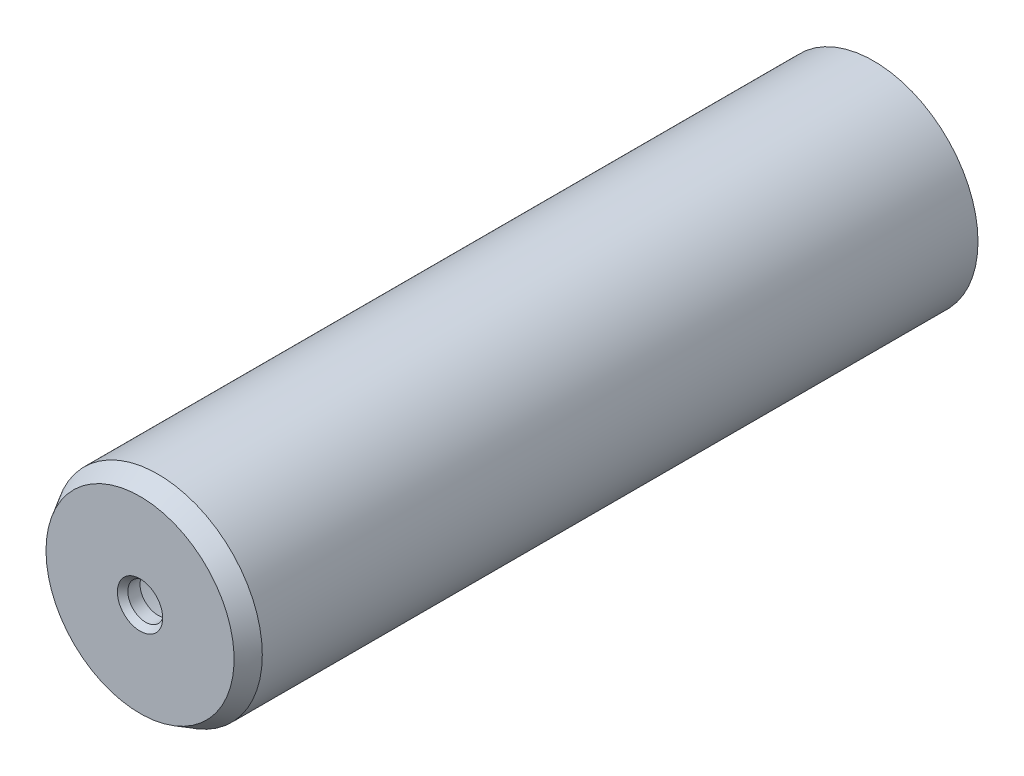
ISO-10303-21;
HEADER;
FILE_DESCRIPTION(('STEP AP214'),'2;1');
FILE_NAME('part.step','',(''),(''),'','','');
FILE_SCHEMA(('AUTOMOTIVE_DESIGN { 1 0 10303 214 1 1 1 1 }'));
ENDSEC;
DATA;
#1=APPLICATION_CONTEXT('core data for automotive mechanical design processes');
#2=APPLICATION_PROTOCOL_DEFINITION('international standard','automotive_design',2000,#1);
#3=PRODUCT_CONTEXT('',#1,'mechanical');
#4=PRODUCT('Part','Part','',(#3));
#5=PRODUCT_RELATED_PRODUCT_CATEGORY('part','',(#4));
#6=PRODUCT_DEFINITION_FORMATION('','',#4);
#7=PRODUCT_DEFINITION_CONTEXT('part definition',#1,'design');
#8=PRODUCT_DEFINITION('design','',#6,#7);
#9=PRODUCT_DEFINITION_SHAPE('','',#8);
#10=(LENGTH_UNIT() NAMED_UNIT(*) SI_UNIT(.MILLI.,.METRE.));
#11=(NAMED_UNIT(*) PLANE_ANGLE_UNIT() SI_UNIT($,.RADIAN.));
#12=(NAMED_UNIT(*) SI_UNIT($,.STERADIAN.) SOLID_ANGLE_UNIT());
#13=UNCERTAINTY_MEASURE_WITH_UNIT(LENGTH_MEASURE(1.E-05),#10,'distance_accuracy_value','');
#14=(GEOMETRIC_REPRESENTATION_CONTEXT(3) GLOBAL_UNCERTAINTY_ASSIGNED_CONTEXT((#13)) GLOBAL_UNIT_ASSIGNED_CONTEXT((#10,
#11,#12)) REPRESENTATION_CONTEXT('',''));
#15=CARTESIAN_POINT('',(0.,0.,0.));
#16=DIRECTION('',(0.,0.,1.));
#17=DIRECTION('',(1.,0.,0.));
#18=AXIS2_PLACEMENT_3D('',#15,#16,#17);
#19=CARTESIAN_POINT('',(0.,0.,0.));
#20=DIRECTION('',(0.,0.,1.));
#21=DIRECTION('',(1.,0.,0.));
#22=AXIS2_PLACEMENT_3D('',#19,#20,#21);
#23=PLANE('',#22);
#24=CARTESIAN_POINT('',(0.,0.,0.));
#25=DIRECTION('',(0.,0.,1.));
#26=DIRECTION('',(1.,0.,0.));
#27=AXIS2_PLACEMENT_3D('',#24,#25,#26);
#28=CIRCLE('',#27,17.5);
#29=CARTESIAN_POINT('',(17.5,0.,0.));
#30=VERTEX_POINT('',#29);
#31=EDGE_CURVE('E106',#30,#30,#28,.T.);
#32=ORIENTED_EDGE('',*,*,#31,.F.);
#33=EDGE_LOOP('',(#32));
#34=FACE_BOUND('',#33,.T.);
#35=CARTESIAN_POINT('',(0.,0.,0.));
#36=DIRECTION('',(0.,0.,1.));
#37=DIRECTION('',(1.,0.,0.));
#38=AXIS2_PLACEMENT_3D('',#35,#36,#37);
#39=CIRCLE('',#38,15.1);
#40=CARTESIAN_POINT('',(15.1,0.,0.));
#41=VERTEX_POINT('',#40);
#42=EDGE_CURVE('E109',#41,#41,#39,.T.);
#43=ORIENTED_EDGE('',*,*,#42,.T.);
#44=EDGE_LOOP('',(#43));
#45=FACE_BOUND('',#44,.T.);
#46=ADVANCED_FACE('F35',(#34,#45),#23,.F.);
#47=CARTESIAN_POINT('',(0.,0.,120.));
#48=DIRECTION('',(0.,0.,-1.));
#49=DIRECTION('',(-1.,0.,0.));
#50=AXIS2_PLACEMENT_3D('',#47,#48,#49);
#51=CYLINDRICAL_SURFACE('',#50,17.5);
#52=CARTESIAN_POINT('',(0.,0.,120.));
#53=DIRECTION('',(0.,0.,1.));
#54=DIRECTION('',(1.,0.,0.));
#55=AXIS2_PLACEMENT_3D('',#52,#53,#54);
#56=CIRCLE('',#55,17.5);
#57=CARTESIAN_POINT('',(-17.5,0.,120.));
#58=VERTEX_POINT('',#57);
#59=EDGE_CURVE('E100',#58,#58,#56,.F.);
#60=ORIENTED_EDGE('',*,*,#59,.T.);
#61=EDGE_LOOP('',(#60));
#62=FACE_BOUND('',#61,.T.);
#63=ORIENTED_EDGE('',*,*,#31,.T.);
#64=EDGE_LOOP('',(#63));
#65=FACE_BOUND('',#64,.T.);
#66=ADVANCED_FACE('F147',(#62,#65),#51,.T.);
#67=CARTESIAN_POINT('',(0.,0.,120.));
#68=DIRECTION('',(0.,0.,-1.));
#69=DIRECTION('',(-1.,0.,0.));
#70=AXIS2_PLACEMENT_3D('',#67,#68,#69);
#71=CYLINDRICAL_SURFACE('',#70,15.1);
#72=CARTESIAN_POINT('',(0.,0.,20.));
#73=DIRECTION('',(0.,0.,-1.));
#74=DIRECTION('',(1.,0.,0.));
#75=AXIS2_PLACEMENT_3D('',#72,#73,#74);
#76=CIRCLE('',#75,15.1);
#77=CARTESIAN_POINT('',(-14.4402018150418,-4.41481274131339,20.));
#78=VERTEX_POINT('',#77);
#79=CARTESIAN_POINT('',(0.,15.1,20.));
#80=VERTEX_POINT('',#79);
#81=EDGE_CURVE('E84',#78,#80,#76,.T.);
#82=ORIENTED_EDGE('',*,*,#81,.T.);
#83=DIRECTION('',(0.,0.,-1.));
#84=VECTOR('',#83,1.);
#85=CARTESIAN_POINT('',(0.,15.1,20.));
#86=LINE('',#85,#84);
#87=CARTESIAN_POINT('',(0.,15.1,6.));
#88=VERTEX_POINT('',#87);
#89=EDGE_CURVE('E75',#80,#88,#86,.T.);
#90=ORIENTED_EDGE('',*,*,#89,.T.);
#91=CARTESIAN_POINT('',(0.,0.,6.));
#92=DIRECTION('',(0.,0.,-1.));
#93=DIRECTION('',(1.,0.,0.));
#94=AXIS2_PLACEMENT_3D('',#91,#92,#93);
#95=CIRCLE('',#94,15.1);
#96=CARTESIAN_POINT('',(-14.4402018150418,-4.41481274131339,6.00000000000001));
#97=VERTEX_POINT('',#96);
#98=EDGE_CURVE('E127',#97,#88,#95,.T.);
#99=ORIENTED_EDGE('',*,*,#98,.F.);
#100=DIRECTION('',(0.,0.,-1.));
#101=VECTOR('',#100,1.);
#102=CARTESIAN_POINT('',(-14.4402018150418,-4.41481274131339,20.));
#103=LINE('',#102,#101);
#104=EDGE_CURVE('E90',#78,#97,#103,.T.);
#105=ORIENTED_EDGE('',*,*,#104,.F.);
#106=EDGE_LOOP('',(#82,#90,#99,#105));
#107=FACE_BOUND('',#106,.T.);
#108=CARTESIAN_POINT('',(0.,0.,120.));
#109=DIRECTION('',(0.,0.,1.));
#110=DIRECTION('',(1.,0.,0.));
#111=AXIS2_PLACEMENT_3D('',#108,#109,#110);
#112=CIRCLE('',#111,15.1);
#113=CARTESIAN_POINT('',(15.1,0.,120.));
#114=VERTEX_POINT('',#113);
#115=EDGE_CURVE('E112',#114,#114,#112,.T.);
#116=ORIENTED_EDGE('',*,*,#115,.T.);
#117=EDGE_LOOP('',(#116));
#118=FACE_BOUND('',#117,.T.);
#119=ORIENTED_EDGE('',*,*,#42,.F.);
#120=EDGE_LOOP('',(#119));
#121=FACE_BOUND('',#120,.T.);
#122=ADVANCED_FACE('F87',(#107,#118,#121),#71,.F.);
#123=CARTESIAN_POINT('',(0.,0.,120.));
#124=DIRECTION('',(0.,0.,1.));
#125=DIRECTION('',(1.,0.,0.));
#126=AXIS2_PLACEMENT_3D('',#123,#124,#125);
#127=PLANE('',#126);
#128=CARTESIAN_POINT('',(0.,0.,120.));
#129=DIRECTION('',(0.,0.,1.));
#130=DIRECTION('',(1.,0.,0.));
#131=AXIS2_PLACEMENT_3D('',#128,#129,#130);
#132=CIRCLE('',#131,3.);
#133=CARTESIAN_POINT('',(3.,0.,120.));
#134=VERTEX_POINT('',#133);
#135=EDGE_CURVE('E115',#134,#134,#132,.T.);
#136=ORIENTED_EDGE('',*,*,#135,.T.);
#137=EDGE_LOOP('',(#136));
#138=FACE_BOUND('',#137,.T.);
#139=ORIENTED_EDGE('',*,*,#115,.F.);
#140=EDGE_LOOP('',(#139));
#141=FACE_BOUND('',#140,.T.);
#142=ADVANCED_FACE('F196',(#138,#141),#127,.F.);
#143=CARTESIAN_POINT('',(0.,0.,123.));
#144=DIRECTION('',(0.,0.,1.));
#145=DIRECTION('',(1.,0.,0.));
#146=AXIS2_PLACEMENT_3D('',#143,#144,#145);
#147=PLANE('',#146);
#148=CARTESIAN_POINT('',(0.,0.,123.));
#149=DIRECTION('',(0.,0.,1.));
#150=DIRECTION('',(1.,0.,0.));
#151=AXIS2_PLACEMENT_3D('',#148,#149,#150);
#152=CIRCLE('',#151,3.8);
#153=CARTESIAN_POINT('',(3.8,0.,123.));
#154=VERTEX_POINT('',#153);
#155=EDGE_CURVE('E11',#154,#154,#152,.F.);
#156=ORIENTED_EDGE('',*,*,#155,.T.);
#157=EDGE_LOOP('',(#156));
#158=FACE_BOUND('',#157,.T.);
#159=CARTESIAN_POINT('',(0.,0.,123.));
#160=DIRECTION('',(0.,0.,1.));
#161=DIRECTION('',(1.,0.,0.));
#162=AXIS2_PLACEMENT_3D('',#159,#160,#161);
#163=CIRCLE('',#162,15.7679491924311);
#164=CARTESIAN_POINT('',(-15.7679491924311,0.,123.));
#165=VERTEX_POINT('',#164);
#166=EDGE_CURVE('E103',#165,#165,#163,.T.);
#167=ORIENTED_EDGE('',*,*,#166,.T.);
#168=EDGE_LOOP('',(#167));
#169=FACE_BOUND('',#168,.T.);
#170=ADVANCED_FACE('F191',(#158,#169),#147,.T.);
#171=CARTESIAN_POINT('',(0.,0.,123.));
#172=DIRECTION('',(0.,0.,-1.));
#173=DIRECTION('',(-1.,0.,0.));
#174=AXIS2_PLACEMENT_3D('',#171,#172,#173);
#175=CYLINDRICAL_SURFACE('',#174,3.);
#176=CARTESIAN_POINT('',(0.,0.,122.046597125925));
#177=DIRECTION('',(0.,0.,1.));
#178=DIRECTION('',(1.,0.,0.));
#179=AXIS2_PLACEMENT_3D('',#176,#177,#178);
#180=CIRCLE('',#179,3.);
#181=CARTESIAN_POINT('',(3.,0.,122.046597125925));
#182=VERTEX_POINT('',#181);
#183=EDGE_CURVE('E43',#182,#182,#180,.T.);
#184=ORIENTED_EDGE('',*,*,#183,.T.);
#185=EDGE_LOOP('',(#184));
#186=FACE_BOUND('',#185,.T.);
#187=ORIENTED_EDGE('',*,*,#135,.F.);
#188=EDGE_LOOP('',(#187));
#189=FACE_BOUND('',#188,.T.);
#190=ADVANCED_FACE('F161',(#186,#189),#175,.F.);
#191=CARTESIAN_POINT('',(0.,0.,123.));
#192=DIRECTION('',(0.,0.,-1.));
#193=DIRECTION('',(-1.,0.,0.));
#194=AXIS2_PLACEMENT_3D('',#191,#192,#193);
#195=CONICAL_SURFACE('',#194,15.7679491924311,0.523598775598295);
#196=CARTESIAN_POINT('',(-17.5,0.,120.));
#197=CARTESIAN_POINT('',(-17.4819578040878,0.,120.03125));
#198=CARTESIAN_POINT('',(-17.4639156081757,0.,120.0625));
#199=CARTESIAN_POINT('',(-17.4278312163513,0.,120.125));
#200=CARTESIAN_POINT('',(-17.4097890204391,0.,120.15625));
#201=CARTESIAN_POINT('',(-17.3737046286148,0.,120.21875));
#202=CARTESIAN_POINT('',(-17.3556624327026,0.,120.25));
#203=CARTESIAN_POINT('',(-17.3195780408783,0.,120.3125));
#204=CARTESIAN_POINT('',(-17.3015358449661,0.,120.34375));
#205=CARTESIAN_POINT('',(-17.2654514531417,0.,120.40625));
#206=CARTESIAN_POINT('',(-17.2474092572295,0.,120.4375));
#207=CARTESIAN_POINT('',(-17.2113248654052,0.,120.5));
#208=CARTESIAN_POINT('',(-17.193282669493,0.,120.53125));
#209=CARTESIAN_POINT('',(-17.1571982776687,0.,120.59375));
#210=CARTESIAN_POINT('',(-17.1391560817565,0.,120.625));
#211=CARTESIAN_POINT('',(-17.1030716899321,0.,120.6875));
#212=CARTESIAN_POINT('',(-17.08502949402,0.,120.71875));
#213=CARTESIAN_POINT('',(-17.0489451021956,0.,120.78125));
#214=CARTESIAN_POINT('',(-17.0309029062834,0.,120.8125));
#215=CARTESIAN_POINT('',(-16.9948185144591,0.,120.875));
#216=CARTESIAN_POINT('',(-16.9767763185469,0.,120.90625));
#217=CARTESIAN_POINT('',(-16.9406919267226,0.,120.96875));
#218=CARTESIAN_POINT('',(-16.9226497308104,0.,121.));
#219=CARTESIAN_POINT('',(-16.886565338986,0.,121.0625));
#220=CARTESIAN_POINT('',(-16.8685231430738,0.,121.09375));
#221=CARTESIAN_POINT('',(-16.8324387512495,0.,121.15625));
#222=CARTESIAN_POINT('',(-16.8143965553373,0.,121.1875));
#223=CARTESIAN_POINT('',(-16.778312163513,0.,121.25));
#224=CARTESIAN_POINT('',(-16.7602699676008,0.,121.28125));
#225=CARTESIAN_POINT('',(-16.7241855757764,0.,121.34375));
#226=CARTESIAN_POINT('',(-16.7061433798643,0.,121.375));
#227=CARTESIAN_POINT('',(-16.6700589880399,0.,121.4375));
#228=CARTESIAN_POINT('',(-16.6520167921277,0.,121.46875));
#229=CARTESIAN_POINT('',(-16.6159324003034,0.,121.53125));
#230=CARTESIAN_POINT('',(-16.5978902043912,0.,121.5625));
#231=CARTESIAN_POINT('',(-16.5618058125669,0.,121.625));
#232=CARTESIAN_POINT('',(-16.5437636166547,0.,121.65625));
#233=CARTESIAN_POINT('',(-16.5076792248303,0.,121.71875));
#234=CARTESIAN_POINT('',(-16.4896370289181,0.,121.75));
#235=CARTESIAN_POINT('',(-16.4535526370938,0.,121.8125));
#236=CARTESIAN_POINT('',(-16.4355104411816,0.,121.84375));
#237=CARTESIAN_POINT('',(-16.3994260493573,0.,121.90625));
#238=CARTESIAN_POINT('',(-16.3813838534451,0.,121.9375));
#239=CARTESIAN_POINT('',(-16.3452994616207,0.,122.));
#240=CARTESIAN_POINT('',(-16.3272572657086,0.,122.03125));
#241=CARTESIAN_POINT('',(-16.2911728738842,0.,122.09375));
#242=CARTESIAN_POINT('',(-16.273130677972,0.,122.125));
#243=CARTESIAN_POINT('',(-16.2370462861477,0.,122.1875));
#244=CARTESIAN_POINT('',(-16.2190040902355,0.,122.21875));
#245=CARTESIAN_POINT('',(-16.1829196984112,0.,122.28125));
#246=CARTESIAN_POINT('',(-16.164877502499,0.,122.3125));
#247=CARTESIAN_POINT('',(-16.1287931106746,0.,122.375));
#248=CARTESIAN_POINT('',(-16.1107509147624,0.,122.40625));
#249=CARTESIAN_POINT('',(-16.0746665229381,0.,122.46875));
#250=CARTESIAN_POINT('',(-16.0566243270259,0.,122.5));
#251=CARTESIAN_POINT('',(-16.0205399352016,0.,122.5625));
#252=CARTESIAN_POINT('',(-16.0024977392894,0.,122.59375));
#253=CARTESIAN_POINT('',(-15.966413347465,0.,122.65625));
#254=CARTESIAN_POINT('',(-15.9483711515529,0.,122.6875));
#255=CARTESIAN_POINT('',(-15.9122867597285,0.,122.75));
#256=CARTESIAN_POINT('',(-15.8942445638163,0.,122.78125));
#257=CARTESIAN_POINT('',(-15.858160171992,0.,122.84375));
#258=CARTESIAN_POINT('',(-15.8401179760798,0.,122.875));
#259=CARTESIAN_POINT('',(-15.8040335842555,0.,122.9375));
#260=CARTESIAN_POINT('',(-15.7859913883433,0.,122.96875));
#261=CARTESIAN_POINT('',(-15.7679491924311,0.,123.));
#262=B_SPLINE_CURVE_WITH_KNOTS('',3,(#196,#197,#198,#199,#200,#201,#202,#203,#204,#205,#206,
#207,#208,#209,#210,#211,#212,#213,#214,#215,#216,#217,#218,#219,#220,#221,#222,#223,#224,#225,
#226,#227,#228,#229,#230,#231,#232,#233,#234,#235,#236,#237,#238,#239,#240,#241,#242,#243,#244,
#245,#246,#247,#248,#249,#250,#251,#252,#253,#254,#255,#256,#257,#258,#259,#260,#261),
.UNSPECIFIED.,.F.,.F.,(4,2,2,2,2,2,2,2,2,2,2,2,2,2,2,2,2,2,2,2,2,2,2,2,2,2,2,2,2,2,2,2,4),(0.,
0.108253175473046,0.216506350946104,0.324759526419162,0.43301270189222,0.54126587736528,
0.649519052838338,0.757772228311396,0.866025403784454,0.974278579257512,1.08253175473057,
1.19078493020363,1.29903810567668,1.40729128114973,1.51554445662279,1.62379763209585,
1.73205080756891,1.84030398304197,1.94855715851503,2.05681033398808,2.16506350946114,
2.2733166849342,2.38156986040725,2.4898230358803,2.59807621135336,2.70632938682642,
2.81458256229948,2.92283573777254,3.0310889132456,3.13934208871865,3.24759526419171,
3.35584843966477,3.46410161513783),.UNSPECIFIED.);
#263=EDGE_CURVE('BSEAM144',#58,#165,#262,.T.);
#264=ORIENTED_EDGE('',*,*,#59,.F.);
#265=ORIENTED_EDGE('',*,*,#166,.F.);
#266=ORIENTED_EDGE('',*,*,#263,.T.);
#267=ORIENTED_EDGE('',*,*,#263,.F.);
#268=EDGE_LOOP('',(#264,#266,#265,#267));
#269=FACE_BOUND('',#268,.T.);
#270=ADVANCED_FACE('F144',(#269),#195,.T.);
#271=CARTESIAN_POINT('',(-10.6149827911897,-3.24532592242242,20.));
#272=DIRECTION('',(0.292371704722741,-0.956304755963034,0.));
#273=DIRECTION('',(0.956304755963034,0.292371704722741,0.));
#274=AXIS2_PLACEMENT_3D('',#271,#272,#273);
#275=PLANE('',#274);
#276=DIRECTION('',(0.,0.,-1.));
#277=VECTOR('',#276,1.);
#278=CARTESIAN_POINT('',(-10.6149827911897,-3.24532592242242,20.));
#279=LINE('',#278,#277);
#280=CARTESIAN_POINT('',(-10.6149827911897,-3.24532592242242,9.01009032218146));
#281=VERTEX_POINT('',#280);
#282=CARTESIAN_POINT('',(-10.6149827911897,-3.24532592242242,6.));
#283=VERTEX_POINT('',#282);
#284=EDGE_CURVE('E119',#281,#283,#279,.T.);
#285=ORIENTED_EDGE('',*,*,#284,.F.);
#286=DIRECTION('',(0.327075489697496,0.0999970123536421,-0.939692620785909));
#287=VECTOR('',#286,1.);
#288=CARTESIAN_POINT('',(0.,0.,-21.4869090337648));
#289=LINE('',#288,#287);
#290=EDGE_CURVE('E50',#281,#78,#289,.F.);
#291=ORIENTED_EDGE('',*,*,#290,.T.);
#292=ORIENTED_EDGE('',*,*,#104,.T.);
#293=DIRECTION('',(-0.956304755963034,-0.292371704722741,0.));
#294=VECTOR('',#293,1.);
#295=CARTESIAN_POINT('',(-10.6149827911897,-3.24532592242242,6.));
#296=LINE('',#295,#294);
#297=EDGE_CURVE('E91',#283,#97,#296,.T.);
#298=ORIENTED_EDGE('',*,*,#297,.F.);
#299=EDGE_LOOP('',(#285,#291,#292,#298));
#300=FACE_BOUND('',#299,.T.);
#301=ADVANCED_FACE('F134',(#300),#275,.T.);
#302=CARTESIAN_POINT('',(0.,0.,20.));
#303=DIRECTION('',(0.,0.,-1.));
#304=DIRECTION('',(-1.,0.,0.));
#305=AXIS2_PLACEMENT_3D('',#302,#303,#304);
#306=CYLINDRICAL_SURFACE('',#305,11.1);
#307=DIRECTION('',(0.,0.,-1.));
#308=VECTOR('',#307,1.);
#309=CARTESIAN_POINT('',(0.,11.1,20.));
#310=LINE('',#309,#308);
#311=CARTESIAN_POINT('',(0.,11.1,9.01009032218146));
#312=VERTEX_POINT('',#311);
#313=CARTESIAN_POINT('',(0.,11.1,6.));
#314=VERTEX_POINT('',#313);
#315=EDGE_CURVE('E83',#312,#314,#310,.T.);
#316=ORIENTED_EDGE('',*,*,#315,.F.);
#317=CARTESIAN_POINT('',(0.,0.,9.01009032218146));
#318=DIRECTION('',(0.,0.,1.));
#319=DIRECTION('',(1.,0.,0.));
#320=AXIS2_PLACEMENT_3D('',#317,#318,#319);
#321=CIRCLE('',#320,11.1);
#322=EDGE_CURVE('E94',#312,#281,#321,.T.);
#323=ORIENTED_EDGE('',*,*,#322,.T.);
#324=ORIENTED_EDGE('',*,*,#284,.T.);
#325=CARTESIAN_POINT('',(0.,0.,6.));
#326=DIRECTION('',(0.,0.,1.));
#327=DIRECTION('',(1.,0.,0.));
#328=AXIS2_PLACEMENT_3D('',#325,#326,#327);
#329=CIRCLE('',#328,11.1);
#330=EDGE_CURVE('E123',#314,#283,#329,.T.);
#331=ORIENTED_EDGE('',*,*,#330,.F.);
#332=EDGE_LOOP('',(#316,#323,#324,#331));
#333=FACE_BOUND('',#332,.T.);
#334=ADVANCED_FACE('F136',(#333),#306,.F.);
#335=CARTESIAN_POINT('',(0.,15.1,20.));
#336=DIRECTION('',(1.,0.,0.));
#337=DIRECTION('',(0.,1.,0.));
#338=AXIS2_PLACEMENT_3D('',#335,#336,#337);
#339=PLANE('',#338);
#340=ORIENTED_EDGE('',*,*,#89,.F.);
#341=DIRECTION('',(0.,0.342020143325669,0.939692620785908));
#342=VECTOR('',#341,1.);
#343=CARTESIAN_POINT('',(0.,0.,-21.4869090337648));
#344=LINE('',#343,#342);
#345=EDGE_CURVE('E58',#80,#312,#344,.F.);
#346=ORIENTED_EDGE('',*,*,#345,.T.);
#347=ORIENTED_EDGE('',*,*,#315,.T.);
#348=DIRECTION('',(0.,-1.,0.));
#349=VECTOR('',#348,1.);
#350=CARTESIAN_POINT('',(0.,15.1,6.));
#351=LINE('',#350,#349);
#352=EDGE_CURVE('E79',#88,#314,#351,.T.);
#353=ORIENTED_EDGE('',*,*,#352,.F.);
#354=EDGE_LOOP('',(#340,#346,#347,#353));
#355=FACE_BOUND('',#354,.T.);
#356=ADVANCED_FACE('F77',(#355),#339,.T.);
#357=CARTESIAN_POINT('',(0.,0.,6.));
#358=DIRECTION('',(0.,0.,1.));
#359=DIRECTION('',(1.,0.,0.));
#360=AXIS2_PLACEMENT_3D('',#357,#358,#359);
#361=PLANE('',#360);
#362=ORIENTED_EDGE('',*,*,#98,.T.);
#363=ORIENTED_EDGE('',*,*,#352,.T.);
#364=ORIENTED_EDGE('',*,*,#330,.T.);
#365=ORIENTED_EDGE('',*,*,#297,.T.);
#366=EDGE_LOOP('',(#362,#363,#364,#365));
#367=FACE_BOUND('',#366,.T.);
#368=ADVANCED_FACE('F129',(#367),#361,.F.);
#369=CARTESIAN_POINT('',(0.,0.,9.01009032218146));
#370=DIRECTION('',(0.,0.,1.));
#371=DIRECTION('',(1.,0.,0.));
#372=AXIS2_PLACEMENT_3D('',#369,#370,#371);
#373=CONICAL_SURFACE('',#372,11.1,0.349065850398867);
#374=ORIENTED_EDGE('',*,*,#345,.F.);
#375=ORIENTED_EDGE('',*,*,#81,.F.);
#376=ORIENTED_EDGE('',*,*,#290,.F.);
#377=ORIENTED_EDGE('',*,*,#322,.F.);
#378=EDGE_LOOP('',(#374,#375,#376,#377));
#379=FACE_BOUND('',#378,.T.);
#380=ADVANCED_FACE('F93',(#379),#373,.F.);
#381=CARTESIAN_POINT('',(0.,0.,122.046597125925));
#382=DIRECTION('',(0.,0.,1.));
#383=DIRECTION('',(1.,0.,0.));
#384=AXIS2_PLACEMENT_3D('',#381,#382,#383);
#385=CONICAL_SURFACE('',#384,3.,0.698131700797727);
#386=ORIENTED_EDGE('',*,*,#155,.F.);
#387=EDGE_LOOP('',(#386));
#388=FACE_BOUND('',#387,.T.);
#389=ORIENTED_EDGE('',*,*,#183,.F.);
#390=EDGE_LOOP('',(#389));
#391=FACE_BOUND('',#390,.T.);
#392=ADVANCED_FACE('F37',(#388,#391),#385,.F.);
#393=CLOSED_SHELL('',(#46,#66,#122,#142,#170,#190,#270,#301,#334,#356,#368,#380,#392));
#394=MANIFOLD_SOLID_BREP('B2',#393);
#395=ADVANCED_BREP_SHAPE_REPRESENTATION('',(#18,#394),#14);
#396=SHAPE_DEFINITION_REPRESENTATION(#9,#395);
ENDSEC;
END-ISO-10303-21;
